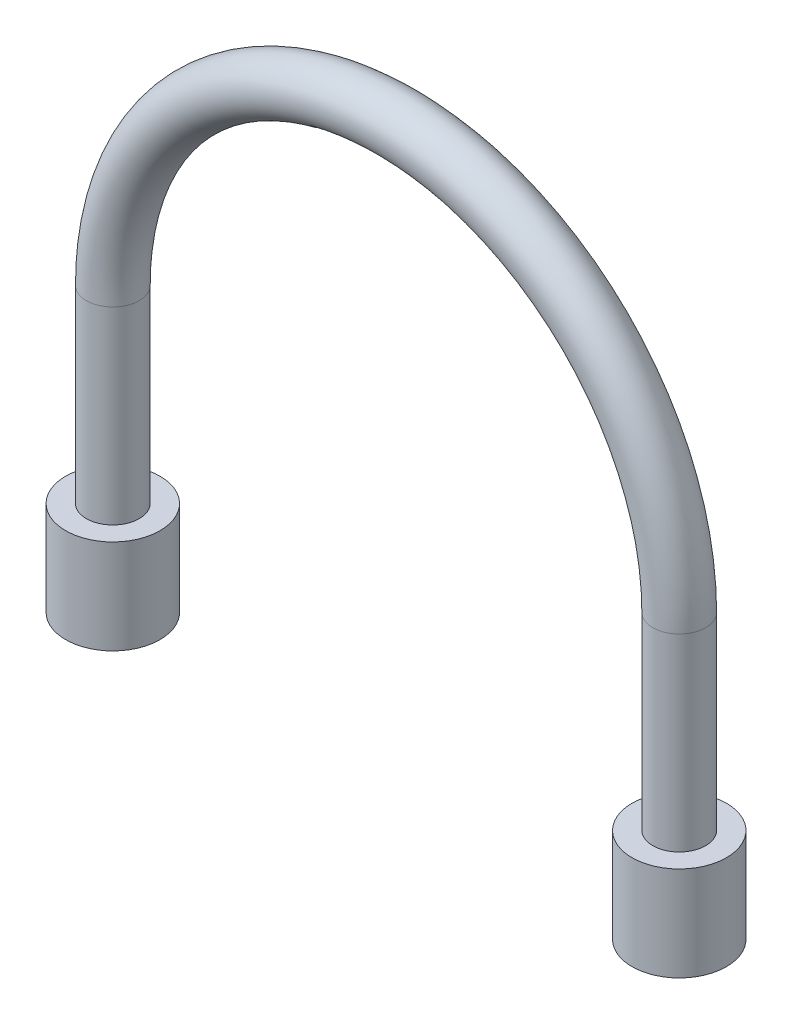
ISO-10303-21;
HEADER;
FILE_DESCRIPTION(('STEP AP214'),'2;1');
FILE_NAME('part.step','',(''),(''),'','','');
FILE_SCHEMA(('AUTOMOTIVE_DESIGN { 1 0 10303 214 1 1 1 1 }'));
ENDSEC;
DATA;
#1=APPLICATION_CONTEXT('core data for automotive mechanical design processes');
#2=APPLICATION_PROTOCOL_DEFINITION('international standard','automotive_design',2000,#1);
#3=PRODUCT_CONTEXT('',#1,'mechanical');
#4=PRODUCT('Part','Part','',(#3));
#5=PRODUCT_RELATED_PRODUCT_CATEGORY('part','',(#4));
#6=PRODUCT_DEFINITION_FORMATION('','',#4);
#7=PRODUCT_DEFINITION_CONTEXT('part definition',#1,'design');
#8=PRODUCT_DEFINITION('design','',#6,#7);
#9=PRODUCT_DEFINITION_SHAPE('','',#8);
#10=(LENGTH_UNIT() NAMED_UNIT(*) SI_UNIT(.MILLI.,.METRE.));
#11=(NAMED_UNIT(*) PLANE_ANGLE_UNIT() SI_UNIT($,.RADIAN.));
#12=(NAMED_UNIT(*) SI_UNIT($,.STERADIAN.) SOLID_ANGLE_UNIT());
#13=UNCERTAINTY_MEASURE_WITH_UNIT(LENGTH_MEASURE(1.E-05),#10,'distance_accuracy_value','');
#14=(GEOMETRIC_REPRESENTATION_CONTEXT(3) GLOBAL_UNCERTAINTY_ASSIGNED_CONTEXT((#13)) GLOBAL_UNIT_ASSIGNED_CONTEXT((#10,
#11,#12)) REPRESENTATION_CONTEXT('',''));
#15=CARTESIAN_POINT('',(0.,0.,0.));
#16=DIRECTION('',(0.,0.,1.));
#17=DIRECTION('',(1.,0.,0.));
#18=AXIS2_PLACEMENT_3D('',#15,#16,#17);
#19=CARTESIAN_POINT('',(0.,12.7,0.));
#20=DIRECTION('',(0.,0.,1.));
#21=DIRECTION('',(1.,0.,0.));
#22=AXIS2_PLACEMENT_3D('',#19,#20,#21);
#23=TOROIDAL_SURFACE('',#22,19.05,1.778);
#24=CARTESIAN_POINT('',(19.05,12.7,0.));
#25=DIRECTION('',(0.,-1.,0.));
#26=DIRECTION('',(0.,0.,1.));
#27=AXIS2_PLACEMENT_3D('',#24,#25,#26);
#28=CIRCLE('',#27,1.778);
#29=CARTESIAN_POINT('',(19.05,12.7,1.778));
#30=VERTEX_POINT('',#29);
#31=EDGE_CURVE('E140',#30,#30,#28,.T.);
#32=ORIENTED_EDGE('',*,*,#31,.F.);
#33=EDGE_LOOP('',(#32));
#34=FACE_BOUND('',#33,.T.);
#35=CARTESIAN_POINT('',(-19.05,12.7,0.));
#36=DIRECTION('',(0.,1.,0.));
#37=DIRECTION('',(0.,0.,1.));
#38=AXIS2_PLACEMENT_3D('',#35,#36,#37);
#39=CIRCLE('',#38,1.778);
#40=CARTESIAN_POINT('',(-19.05,12.7,1.778));
#41=VERTEX_POINT('',#40);
#42=EDGE_CURVE('E143',#41,#41,#39,.T.);
#43=ORIENTED_EDGE('',*,*,#42,.T.);
#44=EDGE_LOOP('',(#43));
#45=FACE_BOUND('',#44,.T.);
#46=CARTESIAN_POINT('',(0.,12.7,-1.29296282227642));
#47=DIRECTION('',(0.,0.,-1.));
#48=DIRECTION('',(-1.,0.,0.));
#49=AXIS2_PLACEMENT_3D('',#46,#47,#48);
#50=CIRCLE('',#49,17.82953650599);
#51=CARTESIAN_POINT('',(1.32814608324219,30.48,-1.29296282227642));
#52=VERTEX_POINT('',#51);
#53=CARTESIAN_POINT('',(4.44765997475827,29.9658823338793,-1.29296282227642));
#54=VERTEX_POINT('',#53);
#55=EDGE_CURVE('E11',#52,#54,#50,.T.);
#56=ORIENTED_EDGE('',*,*,#55,.F.);
#57=CARTESIAN_POINT('',(0.,30.48,1.24434078933386));
#58=CARTESIAN_POINT('',(-0.14832906738404,30.48,1.24433942556282));
#59=CARTESIAN_POINT('',(-0.296656501662229,30.48,1.2462455794243));
#60=CARTESIAN_POINT('',(-0.593219848214549,30.48,1.25374763357387));
#61=CARTESIAN_POINT('',(-0.741455758176201,30.48,1.25934362355559));
#62=CARTESIAN_POINT('',(-1.18599468934,30.48,1.28124371146198));
#63=CARTESIAN_POINT('',(-1.48204669989252,30.48,1.30265965772945));
#64=CARTESIAN_POINT('',(-2.07467912668956,30.48,1.35504578558264));
#65=CARTESIAN_POINT('',(-2.3712551840144,30.48,1.38606163275759));
#66=CARTESIAN_POINT('',(-2.96387386562639,30.48,1.45241304934036));
#67=CARTESIAN_POINT('',(-3.25991653658436,30.48,1.48774822012083));
#68=CARTESIAN_POINT('',(-3.85138148772855,30.48,1.55766919483209));
#69=CARTESIAN_POINT('',(-4.14680357471677,30.48,1.59225657679497));
#70=CARTESIAN_POINT('',(-4.73830046713491,30.48,1.65612287478712));
#71=CARTESIAN_POINT('',(-5.03437537575224,30.48,1.68540088002238));
#72=CARTESIAN_POINT('',(-5.62628317211785,30.48,1.73392949062295));
#73=CARTESIAN_POINT('',(-5.92211282849232,30.48,1.75321716483239));
#74=CARTESIAN_POINT('',(-6.51430938915337,30.48,1.77692960725267));
#75=CARTESIAN_POINT('',(-6.81067594475108,30.48,1.78136191063387));
#76=CARTESIAN_POINT('',(-7.35164844447383,30.48,1.77031120773606));
#77=CARTESIAN_POINT('',(-7.59629816629249,30.48,1.75815561179244));
#78=CARTESIAN_POINT('',(-7.96234364781413,30.48,1.72567046784472));
#79=CARTESIAN_POINT('',(-8.08437145744579,30.48,1.71243868940809));
#80=CARTESIAN_POINT('',(-8.32770409754836,30.48,1.68044444817601));
#81=CARTESIAN_POINT('',(-8.44900899612904,30.48,1.66168251509077));
#82=CARTESIAN_POINT('',(-8.69167175475603,30.48,1.61750733650737));
#83=CARTESIAN_POINT('',(-8.81301805170693,30.48,1.59202955407821));
#84=CARTESIAN_POINT('',(-9.05392476728499,30.48,1.53333176598549));
#85=CARTESIAN_POINT('',(-9.17348424360052,30.48,1.5001078186107));
#86=CARTESIAN_POINT('',(-9.4095199263902,30.48,1.42449247674607));
#87=CARTESIAN_POINT('',(-9.52600034563512,30.48,1.38211442257923));
#88=CARTESIAN_POINT('',(-9.75427039419094,30.48,1.28627748796619));
#89=CARTESIAN_POINT('',(-9.86606622759268,30.48,1.23283385839364));
#90=CARTESIAN_POINT('',(-10.02995072051,30.48,1.14142846542233));
#91=CARTESIAN_POINT('',(-10.0848079643664,30.48,1.10844871773151));
#92=CARTESIAN_POINT('',(-10.1918603571349,30.48,1.03843561412045));
#93=CARTESIAN_POINT('',(-10.2440544584567,30.48,1.00140068077629));
#94=CARTESIAN_POINT('',(-10.39494816687,30.48,0.88389462422178));
#95=CARTESIAN_POINT('',(-10.488786449918,30.48,0.796586395374077));
#96=CARTESIAN_POINT('',(-10.6098945612911,30.48,0.651827121006734));
#97=CARTESIAN_POINT('',(-10.6465430147146,30.48,0.602187611668305));
#98=CARTESIAN_POINT('',(-10.7123352130029,30.48,0.498066057381777));
#99=CARTESIAN_POINT('',(-10.7414797519932,30.48,0.443584525677533));
#100=CARTESIAN_POINT('',(-10.7904506504123,30.48,0.329826580636971));
#101=CARTESIAN_POINT('',(-10.8101772546288,30.48,0.270506306264253));
#102=CARTESIAN_POINT('',(-10.8378879668337,30.48,0.149187714093975));
#103=CARTESIAN_POINT('',(-10.8458877227261,30.48,0.087193078863392));
#104=CARTESIAN_POINT('',(-10.8490760986464,30.48,-0.0303981765128097));
#105=CARTESIAN_POINT('',(-10.8455550100453,30.48,-0.0859626782186291));
#106=CARTESIAN_POINT('',(-10.8288228548039,30.48,-0.195609821040999));
#107=CARTESIAN_POINT('',(-10.8156081078914,30.48,-0.249691891249003));
#108=CARTESIAN_POINT('',(-10.7812551808779,30.48,-0.353059065621651));
#109=CARTESIAN_POINT('',(-10.7604192669774,30.48,-0.402446759640766));
#110=CARTESIAN_POINT('',(-10.7121330873213,30.48,-0.497831226720098));
#111=CARTESIAN_POINT('',(-10.6846809516546,30.48,-0.543827036340136));
#112=CARTESIAN_POINT('',(-10.604570400512,30.48,-0.661339354251319));
#113=CARTESIAN_POINT('',(-10.5472341496546,30.48,-0.729663241715103));
#114=CARTESIAN_POINT('',(-10.4226701482744,30.48,-0.856650735903708));
#115=CARTESIAN_POINT('',(-10.3554118514823,30.48,-0.915283280364058));
#116=CARTESIAN_POINT('',(-10.2248513754438,30.48,-1.01576249795899));
#117=CARTESIAN_POINT('',(-10.1624547131967,30.48,-1.0588084882721));
#118=CARTESIAN_POINT('',(-10.0341609582651,30.48,-1.13937872749011));
#119=CARTESIAN_POINT('',(-9.96826129067002,30.48,-1.17689883598355));
#120=CARTESIAN_POINT('',(-9.833844635062,30.48,-1.24709422191329));
#121=CARTESIAN_POINT('',(-9.76532432686706,30.48,-1.27976307896581));
#122=CARTESIAN_POINT('',(-9.62637485860187,30.48,-1.34078085780379));
#123=CARTESIAN_POINT('',(-9.55594496823854,30.48,-1.36912809859748));
#124=CARTESIAN_POINT('',(-9.341368731157,30.48,-1.44886729184546));
#125=CARTESIAN_POINT('',(-9.19503830342121,30.48,-1.4944060019752));
#126=CARTESIAN_POINT('',(-8.89904671420326,30.48,-1.57311216799833));
#127=CARTESIAN_POINT('',(-8.7493819297414,30.48,-1.60626539438719));
#128=CARTESIAN_POINT('',(-8.44789007572219,30.48,-1.66249429619203));
#129=CARTESIAN_POINT('',(-8.29605930128475,30.48,-1.68554982103882));
#130=CARTESIAN_POINT('',(-8.06764219131946,30.48,-1.71380165919598));
#131=CARTESIAN_POINT('',(-7.99142377220486,30.48,-1.72216149360035));
#132=CARTESIAN_POINT('',(-7.83880026983294,30.48,-1.73695490849018));
#133=CARTESIAN_POINT('',(-7.76239518931195,30.48,-1.74338851704406));
#134=CARTESIAN_POINT('',(-7.52873084161837,30.48,-1.76036155874189));
#135=CARTESIAN_POINT('',(-7.3712621964667,30.48,-1.76806585838981));
#136=CARTESIAN_POINT('',(-7.05613279870614,30.48,-1.77726180339622));
#137=CARTESIAN_POINT('',(-6.8984720109475,30.48,-1.77875205577023));
#138=CARTESIAN_POINT('',(-6.42533198482432,30.48,-1.77545611247559));
#139=CARTESIAN_POINT('',(-6.10990942662233,30.48,-1.76289063314107));
#140=CARTESIAN_POINT('',(-5.47869101709517,30.48,-1.72366317130962));
#141=CARTESIAN_POINT('',(-5.16289954609562,30.48,-1.69693989738216));
#142=CARTESIAN_POINT('',(-4.53211016874405,30.48,-1.63508526638536));
#143=CARTESIAN_POINT('',(-4.21711244992997,30.48,-1.59995208183357));
#144=CARTESIAN_POINT('',(-3.58785056713588,30.48,-1.52688204900654));
#145=CARTESIAN_POINT('',(-3.27358597698632,30.48,-1.48894866716254));
#146=CARTESIAN_POINT('',(-2.64465299008467,30.48,-1.416052692045));
#147=CARTESIAN_POINT('',(-2.32998454422632,30.48,-1.38109050351165));
#148=CARTESIAN_POINT('',(-1.70119091347263,30.48,-1.32051923885632));
#149=CARTESIAN_POINT('',(-1.38707032498647,30.48,-1.29486624078825));
#150=CARTESIAN_POINT('',(-0.915284040640979,30.48,-1.26730557764023));
#151=CARTESIAN_POINT('',(-0.75794007907482,30.48,-1.25993872619587));
#152=CARTESIAN_POINT('',(-0.443112731681238,30.48,-1.24927094460481));
#153=CARTESIAN_POINT('',(-0.285629347858038,30.48,-1.24596995693059));
#154=CARTESIAN_POINT('',(0.0091510729903953,30.48,-1.24380233002499));
#155=CARTESIAN_POINT('',(0.146444463377522,30.48,-1.24442088155517));
#156=CARTESIAN_POINT('',(0.42098042666667,30.48,-1.24887251761324));
#157=CARTESIAN_POINT('',(0.558222998418375,30.48,-1.25270567092883));
#158=CARTESIAN_POINT('',(0.969808116943238,30.48,-1.26878574251349));
#159=CARTESIAN_POINT('',(1.24397585442515,30.48,-1.28561344742461));
#160=CARTESIAN_POINT('',(1.79247908678151,30.48,-1.3286110014619));
#161=CARTESIAN_POINT('',(2.06681188258345,30.48,-1.35481295847462));
#162=CARTESIAN_POINT('',(2.61488940524052,30.48,-1.41253942768396));
#163=CARTESIAN_POINT('',(2.8886341389436,30.48,-1.44406387755647));
#164=CARTESIAN_POINT('',(3.43726944350686,30.48,-1.50855353258454));
#165=CARTESIAN_POINT('',(3.7121592574559,30.48,-1.54152488825208));
#166=CARTESIAN_POINT('',(4.26226628115507,30.48,-1.6049127140827));
#167=CARTESIAN_POINT('',(4.53748351312195,30.48,-1.63532899950668));
#168=CARTESIAN_POINT('',(5.08794583816997,30.48,-1.68983949183663));
#169=CARTESIAN_POINT('',(5.36318948853939,30.48,-1.71394770450439));
#170=CARTESIAN_POINT('',(5.9143531879492,30.48,-1.75214889470619));
#171=CARTESIAN_POINT('',(6.19027302866635,30.48,-1.76624464269961));
#172=CARTESIAN_POINT('',(6.67140758881669,30.48,-1.77835544291611));
#173=CARTESIAN_POINT('',(6.87653305356167,30.48,-1.77957671390768));
#174=CARTESIAN_POINT('',(7.2867987030531,30.48,-1.77202533140112));
#175=CARTESIAN_POINT('',(7.49193876097776,30.48,-1.76324445210929));
#176=CARTESIAN_POINT('',(7.90115247435911,30.48,-1.73308780454988));
#177=CARTESIAN_POINT('',(8.10522707770305,30.48,-1.71172638035673));
#178=CARTESIAN_POINT('',(8.40950537652082,30.48,-1.66766496738101));
#179=CARTESIAN_POINT('',(8.51058720571081,30.48,-1.65098337334524));
#180=CARTESIAN_POINT('',(8.71188268428595,30.48,-1.61305264813645));
#181=CARTESIAN_POINT('',(8.81209650180911,30.48,-1.59180442310125));
#182=CARTESIAN_POINT('',(9.01208651068393,30.48,-1.54389019614019));
#183=CARTESIAN_POINT('',(9.11185270830269,30.48,-1.51718201565267));
#184=CARTESIAN_POINT('',(9.30951760190453,30.48,-1.45763691024503));
#185=CARTESIAN_POINT('',(9.40741707479925,30.48,-1.42480259915725));
#186=CARTESIAN_POINT('',(9.60013292242879,30.48,-1.35212559209844));
#187=CARTESIAN_POINT('',(9.69496071316949,30.48,-1.31231353800598));
#188=CARTESIAN_POINT('',(9.88061747215869,30.48,-1.22435342154715));
#189=CARTESIAN_POINT('',(9.97145090701926,30.48,-1.17621498347693));
#190=CARTESIAN_POINT('',(10.1302974616286,30.48,-1.08021602169051));
#191=CARTESIAN_POINT('',(10.1993424065375,30.48,-1.03407851195558));
#192=CARTESIAN_POINT('',(10.3320086148843,30.48,-0.934277020210657));
#193=CARTESIAN_POINT('',(10.3956225576246,30.48,-0.880603129322188));
#194=CARTESIAN_POINT('',(10.515551643698,30.48,-0.764144693351037));
#195=CARTESIAN_POINT('',(10.5717699075468,30.48,-0.701258431170665));
#196=CARTESIAN_POINT('',(10.6720292306713,30.48,-0.56641844171707));
#197=CARTESIAN_POINT('',(10.7161097310636,30.48,-0.494495216351746));
#198=CARTESIAN_POINT('',(10.7750916687023,30.48,-0.368507451665385));
#199=CARTESIAN_POINT('',(10.7948177388062,30.48,-0.316705749988697));
#200=CARTESIAN_POINT('',(10.825443370375,30.48,-0.210544983639697));
#201=CARTESIAN_POINT('',(10.836350940626,30.48,-0.15618828695276));
#202=CARTESIAN_POINT('',(10.8484079659992,30.48,-0.0461542017571828));
#203=CARTESIAN_POINT('',(10.8495167991245,30.48,0.00952772598494627));
#204=CARTESIAN_POINT('',(10.8417614129888,30.48,0.120194277611967));
#205=CARTESIAN_POINT('',(10.832894500337,30.48,0.175178709122888));
#206=CARTESIAN_POINT('',(10.8066977491258,30.48,0.280059863514624));
#207=CARTESIAN_POINT('',(10.7898232182848,30.48,0.330073009444002));
#208=CARTESIAN_POINT('',(10.7490160123,30.48,0.427097983301613));
#209=CARTESIAN_POINT('',(10.725080601464,30.48,0.474108639330611));
#210=CARTESIAN_POINT('',(10.6566951128115,30.48,0.589535976970096));
#211=CARTESIAN_POINT('',(10.6081942134619,30.48,0.655548232868828));
#212=CARTESIAN_POINT('',(10.5014413000173,30.48,0.779174809891888));
#213=CARTESIAN_POINT('',(10.4431625518463,30.48,0.836765273838413));
#214=CARTESIAN_POINT('',(10.3308507065241,30.48,0.934632715330537));
#215=CARTESIAN_POINT('',(10.2778942528661,30.48,0.976169494304859));
#216=CARTESIAN_POINT('',(10.1685665263106,30.48,1.05450774571796));
#217=CARTESIAN_POINT('',(10.112192944558,30.48,1.09130596279223));
#218=CARTESIAN_POINT('',(9.9391224263203,30.48,1.19543520699848));
#219=CARTESIAN_POINT('',(9.8185937069245,30.48,1.25640395191931));
#220=CARTESIAN_POINT('',(9.57476575623712,30.48,1.36341156777672));
#221=CARTESIAN_POINT('',(9.45160241712499,30.48,1.40977360310973));
#222=CARTESIAN_POINT('',(9.2017305743854,30.48,1.49199269082286));
#223=CARTESIAN_POINT('',(9.07501871576376,30.48,1.52783940693972));
#224=CARTESIAN_POINT('',(8.81928464686741,30.48,1.59081961798084));
#225=CARTESIAN_POINT('',(8.69025912968739,30.48,1.61793938176508));
#226=CARTESIAN_POINT('',(8.4309490229616,30.48,1.66478267959233));
#227=CARTESIAN_POINT('',(8.30066494133482,30.48,1.6845090791536));
#228=CARTESIAN_POINT('',(8.01894501398694,30.48,1.72027642205753));
#229=CARTESIAN_POINT('',(7.86737752288083,30.48,1.73526366721783));
#230=CARTESIAN_POINT('',(7.56369623842292,30.48,1.75823243680003));
#231=CARTESIAN_POINT('',(7.41158231489704,30.48,1.7662121629764));
#232=CARTESIAN_POINT('',(7.10702290388956,30.48,1.77627770585907));
#233=CARTESIAN_POINT('',(6.95457723771584,30.48,1.77835776492963));
#234=CARTESIAN_POINT('',(6.6496926348516,30.48,1.77754333111031));
#235=CARTESIAN_POINT('',(6.49725370092686,30.48,1.77464826900744));
#236=CARTESIAN_POINT('',(6.0391611469432,30.48,1.75970890486243));
#237=CARTESIAN_POINT('',(5.73371622093876,30.48,1.7413888817909));
#238=CARTESIAN_POINT('',(5.12394378911408,30.48,1.69371989557828));
#239=CARTESIAN_POINT('',(4.81961576486805,30.48,1.66437695085645));
#240=CARTESIAN_POINT('',(4.13876731975432,30.48,1.59191405134278));
#241=CARTESIAN_POINT('',(3.7624278120555,30.48,1.54717767784355));
#242=CARTESIAN_POINT('',(3.00956349801014,30.48,1.45809153010534));
#243=CARTESIAN_POINT('',(2.63303867199379,30.48,1.41374189144585));
#244=CARTESIAN_POINT('',(2.0684750888351,30.48,1.35547211709366));
#245=CARTESIAN_POINT('',(1.88087591771911,30.48,1.3374655997062));
#246=CARTESIAN_POINT('',(1.50534369944697,30.48,1.3054201572868));
#247=CARTESIAN_POINT('',(1.31741067429532,30.48,1.29138097986525));
#248=CARTESIAN_POINT('',(0.941325040596504,30.48,1.26839516570356));
#249=CARTESIAN_POINT('',(0.753172602353507,30.48,1.25944582012091));
#250=CARTESIAN_POINT('',(0.376679227518953,30.48,1.24741959379795));
#251=CARTESIAN_POINT('',(0.188338297295176,30.48,1.24434252095881));
#252=CARTESIAN_POINT('',(0.,30.48,1.24434078933386));
#253=B_SPLINE_CURVE_WITH_KNOTS('',3,(#57,#58,#59,#60,#61,#62,#63,#64,#65,#66,#67,#68,#69,#70,
#71,#72,#73,#74,#75,#76,#77,#78,#79,#80,#81,#82,#83,#84,#85,#86,#87,#88,#89,#90,#91,#92,#93,#94,
#95,#96,#97,#98,#99,#100,#101,#102,#103,#104,#105,#106,#107,#108,#109,#110,#111,#112,#113,#114,
#115,#116,#117,#118,#119,#120,#121,#122,#123,#124,#125,#126,#127,#128,#129,#130,#131,#132,#133,
#134,#135,#136,#137,#138,#139,#140,#141,#142,#143,#144,#145,#146,#147,#148,#149,#150,#151,#152,
#153,#154,#155,#156,#157,#158,#159,#160,#161,#162,#163,#164,#165,#166,#167,#168,#169,#170,#171,
#172,#173,#174,#175,#176,#177,#178,#179,#180,#181,#182,#183,#184,#185,#186,#187,#188,#189,#190,
#191,#192,#193,#194,#195,#196,#197,#198,#199,#200,#201,#202,#203,#204,#205,#206,#207,#208,#209,
#210,#211,#212,#213,#214,#215,#216,#217,#218,#219,#220,#221,#222,#223,#224,#225,#226,#227,#228,
#229,#230,#231,#232,#233,#234,#235,#236,#237,#238,#239,#240,#241,#242,#243,#244,#245,#246,#247,
#248,#249,#250,#251,#252),.UNSPECIFIED.,.T.,.F.,(4,2,2,2,2,2,2,2,2,2,2,2,2,2,2,2,2,2,2,2,2,2,2,
2,2,2,2,2,2,2,2,2,2,2,2,2,2,2,2,2,2,2,2,2,2,2,2,2,2,2,2,2,2,2,2,2,2,2,2,2,2,2,2,2,2,2,2,2,2,2,2,
2,2,2,2,2,2,2,2,2,2,2,2,2,2,2,2,2,2,2,2,2,2,2,2,2,2,4),(0.,0.444972317638721,0.889955452194997,
1.78016809287813,2.67468219803914,3.56911381135525,4.4614248427278,5.35388880058702,
6.24301713629593,7.1316944063055,7.86591890793942,8.23404705913002,8.6021399603284,
8.9739079258096,9.34586548351704,9.71728459930834,10.0881951826489,10.2800386285171,
10.4719569663415,10.8530144138296,11.0376265896529,11.2222192202723,11.4087259197758,
11.5949835238869,11.7611253428813,11.9273302715673,12.087553765016,12.2478225948776,
12.5138711625045,12.7807565817674,13.0078466051363,13.2351059253188,13.4626633812449,
13.6903091262589,14.1492762771512,14.6087691189314,15.0691747740957,15.2991827356258,
15.5291873453813,16.001992769713,16.4749041757321,17.4213696895895,18.3719664988293,
19.3227700615778,20.2724157272753,21.2221905483956,22.1674240874924,22.6399267753865,
23.1124227778093,23.5242686267752,23.9361232888555,24.7599291575529,25.5865841017607,
26.4132293668658,27.2438143816146,28.0744593985069,28.9032441837919,29.7317995540387,
30.3469947969638,30.962696343522,31.5776972354288,31.8849605340074,32.1921629197902,
32.5018347984852,32.8113748505769,33.1195881808266,33.42744760573,33.6761676246443,
33.9252177788254,34.1772603012596,34.4284738892864,34.594109521783,34.759594557779,
34.9257653142786,35.0919809466411,35.2497083032802,35.4074968508012,35.6518448076776,
35.8968720727827,36.0984950023375,36.3002557149802,36.7042301485806,37.0985103596206,
37.4931768481964,37.8884613096662,38.2835924080628,38.7403119572356,39.1971486739948,
39.6544310762173,40.1117658004658,41.029384691485,41.9465032970466,43.0834543897879,
44.2207892212314,44.7861408182682,45.3514564413241,45.916470917409,46.4814669099381),.UNSPECIFIED.);
#254=CARTESIAN_POINT('',(-1.32814608325983,30.48,-1.29296282227642));
#255=VERTEX_POINT('',#254);
#256=EDGE_CURVE('E54',#255,#52,#253,.T.);
#257=ORIENTED_EDGE('',*,*,#256,.F.);
#258=CARTESIAN_POINT('',(-4.44765997475827,29.9658823338793,-1.29296282227642));
#259=VERTEX_POINT('',#258);
#260=EDGE_CURVE('E55',#259,#255,#50,.T.);
#261=ORIENTED_EDGE('',*,*,#260,.F.);
#262=CARTESIAN_POINT('',(-4.44765997475827,29.6423570587393,-0.899684095758082));
#263=CARTESIAN_POINT('',(-4.44765997475827,29.6951251936392,-0.986673349579384));
#264=CARTESIAN_POINT('',(-4.44765997475827,29.7554671300749,-1.06917196035064));
#265=CARTESIAN_POINT('',(-4.44765997475827,29.8892963288868,-1.22284832601512));
#266=CARTESIAN_POINT('',(-4.44765997475827,29.9628043937763,-1.29400782389652));
#267=CARTESIAN_POINT('',(-4.44765997475827,30.1205020589771,-1.42297289547455));
#268=CARTESIAN_POINT('',(-4.44765997475827,30.2046722414577,-1.48080221931795));
#269=CARTESIAN_POINT('',(-4.44765997475827,30.3813207404602,-1.58184952743331));
#270=CARTESIAN_POINT('',(-4.44765997475827,30.4737968657575,-1.62507135112197));
#271=CARTESIAN_POINT('',(-4.44765997475827,30.6666555086665,-1.69671003374853));
#272=CARTESIAN_POINT('',(-4.44765997475827,30.7671677862571,-1.72477773843488));
#273=CARTESIAN_POINT('',(-4.44765997475827,30.9714559287488,-1.7639383275001));
#274=CARTESIAN_POINT('',(-4.44765997475827,31.0752323036646,-1.77502854556668));
#275=CARTESIAN_POINT('',(-4.44765997475827,31.2848416051194,-1.77996629546093));
#276=CARTESIAN_POINT('',(-4.44765997475827,31.3906811497027,-1.77353907506353));
#277=CARTESIAN_POINT('',(-4.44765997475827,31.59977278618,-1.74295281586985));
#278=CARTESIAN_POINT('',(-4.44765997475827,31.7030248555206,-1.71879362257114));
#279=CARTESIAN_POINT('',(-4.44765997475827,31.9036075454909,-1.65339762386764));
#280=CARTESIAN_POINT('',(-4.44765997475827,32.0009564026979,-1.61221684668559));
#281=CARTESIAN_POINT('',(-4.44765997475827,32.1871729971936,-1.51379570862488));
#282=CARTESIAN_POINT('',(-4.44765997475827,32.2760415004084,-1.45655679992307));
#283=CARTESIAN_POINT('',(-4.44765997475827,32.440965849671,-1.32873971673809));
#284=CARTESIAN_POINT('',(-4.44765997475827,32.5172294220021,-1.25842970854161));
#285=CARTESIAN_POINT('',(-4.44765997475827,32.6565009352506,-1.10571564426455));
#286=CARTESIAN_POINT('',(-4.44765997475827,32.7195107093897,-1.02331326344126));
#287=CARTESIAN_POINT('',(-4.44765997475827,32.8288361945048,-0.850942664160257));
#288=CARTESIAN_POINT('',(-4.44765997475827,32.8755256408839,-0.761211452274834));
#289=CARTESIAN_POINT('',(-4.44765997475827,32.9528104110612,-0.575066770091401));
#290=CARTESIAN_POINT('',(-4.44765997475827,32.9834078210462,-0.478654167810159));
#291=CARTESIAN_POINT('',(-4.44765997475827,33.0270363885276,-0.284033872242012));
#292=CARTESIAN_POINT('',(-4.44765997475827,33.0404180106438,-0.185904632801517));
#293=CARTESIAN_POINT('',(-4.44765997475827,33.0503410977045,0.011198877584277));
#294=CARTESIAN_POINT('',(-4.44765997475827,33.0468837792862,0.110173086963526));
#295=CARTESIAN_POINT('',(-4.44765997475827,33.0233574913348,0.305162529772513));
#296=CARTESIAN_POINT('',(-4.44765997475827,33.0034472554391,0.401196980424917));
#297=CARTESIAN_POINT('',(-4.44765997475827,32.9478537458055,0.588581349385725));
#298=CARTESIAN_POINT('',(-4.44765997475827,32.9121704539884,0.679931262324536));
#299=CARTESIAN_POINT('',(-4.44765997475827,32.8259518136468,0.855820784695065));
#300=CARTESIAN_POINT('',(-4.44765997475827,32.7753520805958,0.940328803563293));
#301=CARTESIAN_POINT('',(-4.44765997475827,32.660902327208,1.09983063375279));
#302=CARTESIAN_POINT('',(-4.44765997475827,32.5970514037158,1.17482379601256));
#303=CARTESIAN_POINT('',(-4.44765997475827,32.4568104120412,1.31453778152089));
#304=CARTESIAN_POINT('',(-4.44765997475827,32.3802289797054,1.37906642685735));
#305=CARTESIAN_POINT('',(-4.44765997475827,32.2175323892254,1.49470296988847));
#306=CARTESIAN_POINT('',(-4.44765997475827,32.1314161542511,1.54580934951316));
#307=CARTESIAN_POINT('',(-4.44765997475827,31.9499243189372,1.63443703099047));
#308=CARTESIAN_POINT('',(-4.44765997475827,31.8543779567365,1.67160863165959));
#309=CARTESIAN_POINT('',(-4.44765997475827,31.658483743162,1.72977996440748));
#310=CARTESIAN_POINT('',(-4.44765997475827,31.5581352888465,1.75077766003236));
#311=CARTESIAN_POINT('',(-4.44765997475827,31.3530782284596,1.77644392841716));
#312=CARTESIAN_POINT('',(-4.44765997475827,31.2483223130024,1.78073531176855));
#313=CARTESIAN_POINT('',(-4.44765997475827,31.0395439369408,1.77189554074552));
#314=CARTESIAN_POINT('',(-4.44765997475827,30.935521544752,1.75876278227966));
#315=CARTESIAN_POINT('',(-4.44765997475827,30.7298775070245,1.71516203901682));
#316=CARTESIAN_POINT('',(-4.44765997475827,30.6282989162488,1.684490480013));
#317=CARTESIAN_POINT('',(-4.44765997475827,30.4317723339399,1.60642957826865));
#318=CARTESIAN_POINT('',(-4.44765997475827,30.3368243880736,1.55904012040141));
#319=CARTESIAN_POINT('',(-4.44765997475827,30.1569620966647,1.44908204169032));
#320=CARTESIAN_POINT('',(-4.44765997475827,30.0719893421436,1.38660908713485));
#321=CARTESIAN_POINT('',(-4.44765997475827,29.9140681183662,1.24795534963223));
#322=CARTESIAN_POINT('',(-4.44765997475827,29.8411181740553,1.17177625066682));
#323=CARTESIAN_POINT('',(-4.44765997475827,29.7112908072355,1.00982012281524));
#324=CARTESIAN_POINT('',(-4.44765997475827,29.6540638988195,0.924323433799443));
#325=CARTESIAN_POINT('',(-4.44765997475827,29.5553372992935,0.744688622466349));
#326=CARTESIAN_POINT('',(-4.44765997475827,29.5138337375562,0.650552633989013));
#327=CARTESIAN_POINT('',(-4.44765997475827,29.4491109140748,0.459575109080514));
#328=CARTESIAN_POINT('',(-4.44765997475827,29.4253456079911,0.362918476390398));
#329=CARTESIAN_POINT('',(-4.44765997475827,29.3947877861842,0.166933004869579));
#330=CARTESIAN_POINT('',(-4.44765997475827,29.3879971639292,0.0676038691792107));
#331=CARTESIAN_POINT('',(-4.44765997475827,29.3915965651462,-0.128562266697629));
#332=CARTESIAN_POINT('',(-4.44765997475827,29.401616470397,-0.225406519635093));
#333=CARTESIAN_POINT('',(-4.44765997475827,29.4377827383768,-0.415942777689523));
#334=CARTESIAN_POINT('',(-4.44765997475827,29.4639081674827,-0.509638708494756));
#335=CARTESIAN_POINT('',(-4.44765997475827,29.5169129505252,-0.652475196540216));
#336=CARTESIAN_POINT('',(-4.44765997475827,29.538709537935,-0.703561383041722));
#337=CARTESIAN_POINT('',(-4.44765997475827,29.5870385622628,-0.803438493684511));
#338=CARTESIAN_POINT('',(-4.44765997475827,29.6135708480786,-0.852229490995784));
#339=CARTESIAN_POINT('',(-4.44765997475827,29.6423570587393,-0.899684095758082));
#340=B_SPLINE_CURVE_WITH_KNOTS('',3,(#262,#263,#264,#265,#266,#267,#268,#269,#270,#271,#272,
#273,#274,#275,#276,#277,#278,#279,#280,#281,#282,#283,#284,#285,#286,#287,#288,#289,#290,#291,
#292,#293,#294,#295,#296,#297,#298,#299,#300,#301,#302,#303,#304,#305,#306,#307,#308,#309,#310,
#311,#312,#313,#314,#315,#316,#317,#318,#319,#320,#321,#322,#323,#324,#325,#326,#327,#328,#329,
#330,#331,#332,#333,#334,#335,#336,#337,#338,#339),.UNSPECIFIED.,.T.,.F.,(4,2,2,2,2,2,2,2,2,2,2,
2,2,2,2,2,2,2,2,2,2,2,2,2,2,2,2,2,2,2,2,2,2,2,2,2,2,2,4),(0.,0.305018151278483,
0.610522552892204,0.915478361146573,1.22035395275509,1.53198287939477,1.84366074230185,
2.16025512935855,2.47685227500194,2.7924155054525,3.10795020792753,3.41761079280618,
3.72722851824939,4.02920247738343,4.33113727867363,4.62682288395491,4.92248712585355,
5.21533172668452,5.50817666317749,5.80230460452207,6.09645259920065,6.39550630358441,
6.69459381665209,7.00075155601063,7.30694783734448,7.62001853914058,7.93311806467346,
8.24992774435461,8.56673960576716,8.88159258228504,9.19640690132003,9.50352092851382,
9.81055930403031,10.1077047020689,10.4048832441885,10.6956042853743,10.9859482478292,
11.1523478540999,11.3187421519977),.UNSPECIFIED.);
#341=CARTESIAN_POINT('',(-4.44765997475827,29.9658823338793,1.29296282227642));
#342=VERTEX_POINT('',#341);
#343=EDGE_CURVE('E178',#342,#259,#340,.T.);
#344=ORIENTED_EDGE('',*,*,#343,.F.);
#345=CARTESIAN_POINT('',(0.,12.7,1.29296282227642));
#346=DIRECTION('',(0.,0.,1.));
#347=DIRECTION('',(1.,0.,0.));
#348=AXIS2_PLACEMENT_3D('',#345,#346,#347);
#349=CIRCLE('',#348,17.82953650599);
#350=CARTESIAN_POINT('',(-1.3281460832601,30.48,1.29296282227642));
#351=VERTEX_POINT('',#350);
#352=EDGE_CURVE('E70',#351,#342,#349,.T.);
#353=ORIENTED_EDGE('',*,*,#352,.F.);
#354=CARTESIAN_POINT('',(1.32814608327773,30.48,1.29296282227892));
#355=VERTEX_POINT('',#354);
#356=EDGE_CURVE('E105',#355,#351,#253,.T.);
#357=ORIENTED_EDGE('',*,*,#356,.F.);
#358=CARTESIAN_POINT('',(4.44765997475827,29.9658823338686,1.29296282227642));
#359=VERTEX_POINT('',#358);
#360=EDGE_CURVE('E182',#359,#355,#349,.T.);
#361=ORIENTED_EDGE('',*,*,#360,.F.);
#362=CARTESIAN_POINT('',(4.44765997475827,29.6423570587393,-0.899684095758082));
#363=CARTESIAN_POINT('',(4.44765997475827,29.5917820165739,-0.816293262561566));
#364=CARTESIAN_POINT('',(4.44765997475827,29.5480920023384,-0.728658318400231));
#365=CARTESIAN_POINT('',(4.44765997475827,29.4759523473589,-0.547254884666396));
#366=CARTESIAN_POINT('',(4.44765997475827,29.4475156577865,-0.453481258461572));
#367=CARTESIAN_POINT('',(4.44765997475827,29.4068849701377,-0.262433448047957));
#368=CARTESIAN_POINT('',(4.44765997475827,29.3946961743417,-0.165158152901812));
#369=CARTESIAN_POINT('',(4.44765997475827,29.3870154362259,0.030029529654945));
#370=CARTESIAN_POINT('',(4.44765997475827,29.3915199840229,0.127941778820557));
#371=CARTESIAN_POINT('',(4.44765997475827,29.416929603581,0.32062686008244));
#372=CARTESIAN_POINT('',(4.44765997475827,29.4376729681807,0.415421095526327));
#373=CARTESIAN_POINT('',(4.44765997475827,29.4946545847596,0.600226871278536));
#374=CARTESIAN_POINT('',(4.44765997475827,29.5308935575976,0.69023818886551));
#375=CARTESIAN_POINT('',(4.44765997475827,29.6180396231722,0.86377725732966));
#376=CARTESIAN_POINT('',(4.44765997475827,29.669065243679,0.947245402412815));
#377=CARTESIAN_POINT('',(4.44765997475827,29.7840601626249,1.10472218791867));
#378=CARTESIAN_POINT('',(4.44765997475827,29.8480309815076,1.17872971550233));
#379=CARTESIAN_POINT('',(4.44765997475827,29.9888976618416,1.31732402478537));
#380=CARTESIAN_POINT('',(4.44765997475827,30.0660936046676,1.38160568735278));
#381=CARTESIAN_POINT('',(4.44765997475827,30.2299062642548,1.49676332164065));
#382=CARTESIAN_POINT('',(4.44765997475827,30.3165244570493,1.54763718869107));
#383=CARTESIAN_POINT('',(4.44765997475827,30.4996066448934,1.63615891392778));
#384=CARTESIAN_POINT('',(4.44765997475827,30.5962925778567,1.67334802927496));
#385=CARTESIAN_POINT('',(4.44765997475827,30.7944621133567,1.7313394959053));
#386=CARTESIAN_POINT('',(4.44765997475827,30.8959463279105,1.75213975079275));
#387=CARTESIAN_POINT('',(4.44765997475827,31.1030697028286,1.77709266515774));
#388=CARTESIAN_POINT('',(4.44765997475827,31.20875138962,1.78089383088256));
#389=CARTESIAN_POINT('',(4.44765997475827,31.4192652577578,1.7707481954071));
#390=CARTESIAN_POINT('',(4.44765997475827,31.524097404611,1.75680067716625));
#391=CARTESIAN_POINT('',(4.44765997475827,31.7301479450109,1.71139166520765));
#392=CARTESIAN_POINT('',(4.44765997475827,31.8313579243849,1.67989189448724));
#393=CARTESIAN_POINT('',(4.44765997475827,32.0269307665435,1.60009343218818));
#394=CARTESIAN_POINT('',(4.44765997475827,32.1212940553675,1.55179578695276));
#395=CARTESIAN_POINT('',(4.44765997475827,32.2989355673818,1.4404803906634));
#396=CARTESIAN_POINT('',(4.44765997475827,32.3823587421792,1.37769412672943));
#397=CARTESIAN_POINT('',(4.44765997475827,32.5371501775996,1.23869056932644));
#398=CARTESIAN_POINT('',(4.44765997475827,32.6085200203838,1.16247504131574));
#399=CARTESIAN_POINT('',(4.44765997475827,32.7353405235326,1.00073639789691));
#400=CARTESIAN_POINT('',(4.44765997475827,32.7911324184498,0.915480858722338));
#401=CARTESIAN_POINT('',(4.44765997475827,32.8872205971266,0.736642717909945));
#402=CARTESIAN_POINT('',(4.44765997475827,32.9275190196079,0.643061267780076));
#403=CARTESIAN_POINT('',(4.44765997475827,32.9905546976119,0.452526008072873));
#404=CARTESIAN_POINT('',(4.44765997475827,33.0136707121179,0.355697402144994));
#405=CARTESIAN_POINT('',(4.44765997475827,33.0430752123146,0.15952000402179));
#406=CARTESIAN_POINT('',(4.44765997475827,33.0493652439958,0.0601714442095047));
#407=CARTESIAN_POINT('',(4.44765997475827,33.0449439705046,-0.136824177170146));
#408=CARTESIAN_POINT('',(4.44765997475827,33.0344566302986,-0.234476352671657));
#409=CARTESIAN_POINT('',(4.44765997475827,32.9972376164605,-0.426629914229119));
#410=CARTESIAN_POINT('',(4.44765997475827,32.9705062643951,-0.52113136261784));
#411=CARTESIAN_POINT('',(4.44765997475827,32.9016319088302,-0.70437161946245));
#412=CARTESIAN_POINT('',(4.44765997475827,32.8594834365262,-0.793108369878874));
#413=CARTESIAN_POINT('',(4.44765997475827,32.7610776483372,-0.962373124985787));
#414=CARTESIAN_POINT('',(4.44765997475827,32.7048196337844,-1.04290072290264));
#415=CARTESIAN_POINT('',(4.44765997475827,32.5790261167679,-1.19466527303675));
#416=CARTESIAN_POINT('',(4.44765997475827,32.5093212360333,-1.2657617496491));
#417=CARTESIAN_POINT('',(4.44765997475827,32.3591954697137,-1.39555294983795));
#418=CARTESIAN_POINT('',(4.44765997475827,32.2787734607105,-1.45424637159954));
#419=CARTESIAN_POINT('',(4.44765997475827,32.1075867608085,-1.55897739785217));
#420=CARTESIAN_POINT('',(4.44765997475827,32.0166309888482,-1.60470261160615));
#421=CARTESIAN_POINT('',(4.44765997475827,31.8284603317546,-1.68063783993124));
#422=CARTESIAN_POINT('',(4.44765997475827,31.731244649914,-1.71084587520018));
#423=CARTESIAN_POINT('',(4.44765997475827,31.5308435181759,-1.75560953113342));
#424=CARTESIAN_POINT('',(4.44765997475827,31.4275711042798,-1.76977614346652));
#425=CARTESIAN_POINT('',(4.44765997475827,31.2201055088491,-1.78086670294266));
#426=CARTESIAN_POINT('',(4.44765997475827,31.1159122626672,-1.77778942971737));
#427=CARTESIAN_POINT('',(4.44765997475827,30.9078258635248,-1.75432420976553));
#428=CARTESIAN_POINT('',(4.44765997475827,30.8039632267705,-1.733664655875));
#429=CARTESIAN_POINT('',(4.44765997475827,30.601145888904,-1.67519230445116));
#430=CARTESIAN_POINT('',(4.44765997475827,30.5021925637523,-1.6373747277359));
#431=CARTESIAN_POINT('',(4.44765997475827,30.3121180654445,-1.54554099396049));
#432=CARTESIAN_POINT('',(4.44765997475827,30.2209964203778,-1.49152581379498));
#433=CARTESIAN_POINT('',(4.44765997475827,30.0494366898981,-1.36870736437158));
#434=CARTESIAN_POINT('',(4.44765997475827,29.9689850716256,-1.29992312264574));
#435=CARTESIAN_POINT('',(4.44765997475827,29.8469753136196,-1.17561920358286));
#436=CARTESIAN_POINT('',(4.44765997475827,29.8016092059531,-1.12378093817971));
#437=CARTESIAN_POINT('',(4.44765997475827,29.7171390875761,-1.01522708535502));
#438=CARTESIAN_POINT('',(4.44765997475827,29.6780349033103,-0.95851163317658));
#439=CARTESIAN_POINT('',(4.44765997475827,29.6423570587393,-0.899684095758082));
#440=B_SPLINE_CURVE_WITH_KNOTS('',3,(#362,#363,#364,#365,#366,#367,#368,#369,#370,#371,#372,
#373,#374,#375,#376,#377,#378,#379,#380,#381,#382,#383,#384,#385,#386,#387,#388,#389,#390,#391,
#392,#393,#394,#395,#396,#397,#398,#399,#400,#401,#402,#403,#404,#405,#406,#407,#408,#409,#410,
#411,#412,#413,#414,#415,#416,#417,#418,#419,#420,#421,#422,#423,#424,#425,#426,#427,#428,#429,
#430,#431,#432,#433,#434,#435,#436,#437,#438,#439),.UNSPECIFIED.,.T.,.F.,(4,2,2,2,2,2,2,2,2,2,2,
2,2,2,2,2,2,2,2,2,2,2,2,2,2,2,2,2,2,2,2,2,2,2,2,2,2,2,4),(0.,0.292342889999951,
0.584933608833948,0.877617987416199,1.17024083070922,1.45998621998763,1.7497450897469,
2.04189410558904,2.3340774549462,2.63408014076828,2.93412989108325,3.24347837688111,
3.55286642684534,3.86862303636015,4.18439240273556,4.50085309215898,4.81729407270699,
5.1289919895429,5.44064896000483,5.74481909755131,6.04894723231026,6.3461545300965,
6.64333451919918,6.93658037669878,7.22982042928889,7.5231646018529,7.81652330292438,
8.11385195834896,8.41121180567282,8.71522182055091,9.01927060396905,9.33054453642883,
9.64184049835803,9.95803444218504,10.2743165125412,10.5905795114255,10.9064374758669,
11.1126746411715,11.3189060894168),.UNSPECIFIED.);
#441=EDGE_CURVE('E45',#54,#359,#440,.T.);
#442=ORIENTED_EDGE('',*,*,#441,.F.);
#443=EDGE_LOOP('',(#56,#257,#261,#344,#353,#357,#361,#442));
#444=FACE_BOUND('',#443,.T.);
#445=ADVANCED_FACE('F41',(#34,#45,#444),#23,.T.);
#446=CARTESIAN_POINT('',(19.05,0.,0.));
#447=DIRECTION('',(0.,1.,0.));
#448=DIRECTION('',(0.,0.,1.));
#449=AXIS2_PLACEMENT_3D('',#446,#447,#448);
#450=CYLINDRICAL_SURFACE('',#449,1.778);
#451=CARTESIAN_POINT('',(19.05,0.,0.));
#452=DIRECTION('',(0.,-1.,0.));
#453=DIRECTION('',(0.,0.,1.));
#454=AXIS2_PLACEMENT_3D('',#451,#452,#453);
#455=CIRCLE('',#454,1.778);
#456=CARTESIAN_POINT('',(19.05,0.,1.778));
#457=VERTEX_POINT('',#456);
#458=EDGE_CURVE('E137',#457,#457,#455,.T.);
#459=CARTESIAN_POINT('',(19.05,12.7,1.778));
#460=CARTESIAN_POINT('',(19.05,12.5677083333333,1.778));
#461=CARTESIAN_POINT('',(19.05,12.4354166666667,1.778));
#462=CARTESIAN_POINT('',(19.05,12.1708333333333,1.778));
#463=CARTESIAN_POINT('',(19.05,12.0385416666667,1.778));
#464=CARTESIAN_POINT('',(19.05,11.7739583333333,1.778));
#465=CARTESIAN_POINT('',(19.05,11.6416666666667,1.778));
#466=CARTESIAN_POINT('',(19.05,11.3770833333333,1.778));
#467=CARTESIAN_POINT('',(19.05,11.2447916666667,1.778));
#468=CARTESIAN_POINT('',(19.05,10.9802083333333,1.778));
#469=CARTESIAN_POINT('',(19.05,10.8479166666667,1.778));
#470=CARTESIAN_POINT('',(19.05,10.5833333333333,1.778));
#471=CARTESIAN_POINT('',(19.05,10.4510416666667,1.778));
#472=CARTESIAN_POINT('',(19.05,10.1864583333333,1.778));
#473=CARTESIAN_POINT('',(19.05,10.0541666666667,1.778));
#474=CARTESIAN_POINT('',(19.05,9.78958333333333,1.778));
#475=CARTESIAN_POINT('',(19.05,9.65729166666667,1.778));
#476=CARTESIAN_POINT('',(19.05,9.39270833333333,1.778));
#477=CARTESIAN_POINT('',(19.05,9.26041666666667,1.778));
#478=CARTESIAN_POINT('',(19.05,8.99583333333334,1.778));
#479=CARTESIAN_POINT('',(19.05,8.86354166666667,1.778));
#480=CARTESIAN_POINT('',(19.05,8.59895833333333,1.778));
#481=CARTESIAN_POINT('',(19.05,8.46666666666667,1.778));
#482=CARTESIAN_POINT('',(19.05,8.20208333333333,1.778));
#483=CARTESIAN_POINT('',(19.05,8.06979166666667,1.778));
#484=CARTESIAN_POINT('',(19.05,7.80520833333333,1.778));
#485=CARTESIAN_POINT('',(19.05,7.67291666666667,1.778));
#486=CARTESIAN_POINT('',(19.05,7.40833333333333,1.778));
#487=CARTESIAN_POINT('',(19.05,7.27604166666667,1.778));
#488=CARTESIAN_POINT('',(19.05,7.01145833333333,1.778));
#489=CARTESIAN_POINT('',(19.05,6.87916666666667,1.778));
#490=CARTESIAN_POINT('',(19.05,6.61458333333333,1.778));
#491=CARTESIAN_POINT('',(19.05,6.48229166666667,1.778));
#492=CARTESIAN_POINT('',(19.05,6.21770833333333,1.778));
#493=CARTESIAN_POINT('',(19.05,6.08541666666667,1.778));
#494=CARTESIAN_POINT('',(19.05,5.82083333333333,1.778));
#495=CARTESIAN_POINT('',(19.05,5.68854166666667,1.778));
#496=CARTESIAN_POINT('',(19.05,5.42395833333333,1.778));
#497=CARTESIAN_POINT('',(19.05,5.29166666666667,1.778));
#498=CARTESIAN_POINT('',(19.05,5.02708333333333,1.778));
#499=CARTESIAN_POINT('',(19.05,4.89479166666667,1.778));
#500=CARTESIAN_POINT('',(19.05,4.63020833333333,1.778));
#501=CARTESIAN_POINT('',(19.05,4.49791666666667,1.778));
#502=CARTESIAN_POINT('',(19.05,4.23333333333333,1.778));
#503=CARTESIAN_POINT('',(19.05,4.10104166666667,1.778));
#504=CARTESIAN_POINT('',(19.05,3.83645833333333,1.778));
#505=CARTESIAN_POINT('',(19.05,3.70416666666667,1.778));
#506=CARTESIAN_POINT('',(19.05,3.43958333333333,1.778));
#507=CARTESIAN_POINT('',(19.05,3.30729166666667,1.778));
#508=CARTESIAN_POINT('',(19.05,3.04270833333333,1.778));
#509=CARTESIAN_POINT('',(19.05,2.91041666666667,1.778));
#510=CARTESIAN_POINT('',(19.05,2.64583333333333,1.778));
#511=CARTESIAN_POINT('',(19.05,2.51354166666667,1.778));
#512=CARTESIAN_POINT('',(19.05,2.24895833333333,1.778));
#513=CARTESIAN_POINT('',(19.05,2.11666666666667,1.778));
#514=CARTESIAN_POINT('',(19.05,1.85208333333333,1.778));
#515=CARTESIAN_POINT('',(19.05,1.71979166666667,1.778));
#516=CARTESIAN_POINT('',(19.05,1.45520833333333,1.778));
#517=CARTESIAN_POINT('',(19.05,1.32291666666667,1.778));
#518=CARTESIAN_POINT('',(19.05,1.05833333333333,1.778));
#519=CARTESIAN_POINT('',(19.05,0.926041666666666,1.778));
#520=CARTESIAN_POINT('',(19.05,0.661458333333333,1.778));
#521=CARTESIAN_POINT('',(19.05,0.529166666666666,1.778));
#522=CARTESIAN_POINT('',(19.05,0.264583333333333,1.778));
#523=CARTESIAN_POINT('',(19.05,0.132291666666666,1.778));
#524=CARTESIAN_POINT('',(19.05,0.,1.778));
#525=B_SPLINE_CURVE_WITH_KNOTS('',3,(#459,#460,#461,#462,#463,#464,#465,#466,#467,#468,#469,
#470,#471,#472,#473,#474,#475,#476,#477,#478,#479,#480,#481,#482,#483,#484,#485,#486,#487,#488,
#489,#490,#491,#492,#493,#494,#495,#496,#497,#498,#499,#500,#501,#502,#503,#504,#505,#506,#507,
#508,#509,#510,#511,#512,#513,#514,#515,#516,#517,#518,#519,#520,#521,#522,#523,#524),
.UNSPECIFIED.,.F.,.F.,(4,2,2,2,2,2,2,2,2,2,2,2,2,2,2,2,2,2,2,2,2,2,2,2,2,2,2,2,2,2,2,2,4),(0.,
0.396875,0.793749999999999,1.190625,1.5875,1.984375,2.38125,2.778125,3.175,3.571875,3.96875,
4.365625,4.7625,5.159375,5.55625,5.953125,6.35,6.746875,7.14375,7.540625,7.9375,8.334375,
8.73125,9.128125,9.525,9.921875,10.31875,10.715625,11.1125,11.509375,11.90625,12.303125,12.7),.UNSPECIFIED.);
#526=EDGE_CURVE('BSEAM201',#30,#457,#525,.T.);
#527=ORIENTED_EDGE('',*,*,#31,.T.);
#528=ORIENTED_EDGE('',*,*,#458,.F.);
#529=ORIENTED_EDGE('',*,*,#526,.T.);
#530=ORIENTED_EDGE('',*,*,#526,.F.);
#531=EDGE_LOOP('',(#527,#529,#528,#530));
#532=FACE_BOUND('',#531,.T.);
#533=ADVANCED_FACE('F201',(#532),#450,.T.);
#534=CARTESIAN_POINT('',(-19.05,12.7,0.));
#535=DIRECTION('',(0.,-1.,0.));
#536=DIRECTION('',(0.,0.,-1.));
#537=AXIS2_PLACEMENT_3D('',#534,#535,#536);
#538=CYLINDRICAL_SURFACE('',#537,1.778);
#539=CARTESIAN_POINT('',(-19.05,0.,0.));
#540=DIRECTION('',(0.,1.,0.));
#541=DIRECTION('',(0.,0.,1.));
#542=AXIS2_PLACEMENT_3D('',#539,#540,#541);
#543=CIRCLE('',#542,1.778);
#544=CARTESIAN_POINT('',(-19.05,0.,1.778));
#545=VERTEX_POINT('',#544);
#546=EDGE_CURVE('E134',#545,#545,#543,.T.);
#547=ORIENTED_EDGE('',*,*,#546,.T.);
#548=EDGE_LOOP('',(#547));
#549=FACE_BOUND('',#548,.T.);
#550=ORIENTED_EDGE('',*,*,#42,.F.);
#551=EDGE_LOOP('',(#550));
#552=FACE_BOUND('',#551,.T.);
#553=ADVANCED_FACE('F43',(#549,#552),#538,.T.);
#554=CARTESIAN_POINT('',(-19.05,-6.35,0.));
#555=DIRECTION('',(0.,1.,0.));
#556=DIRECTION('',(0.,0.,1.));
#557=AXIS2_PLACEMENT_3D('',#554,#555,#556);
#558=CYLINDRICAL_SURFACE('',#557,3.175);
#559=CARTESIAN_POINT('',(-19.05,-6.35,0.));
#560=DIRECTION('',(0.,-1.,0.));
#561=DIRECTION('',(0.,0.,-1.));
#562=AXIS2_PLACEMENT_3D('',#559,#560,#561);
#563=CIRCLE('',#562,3.175);
#564=CARTESIAN_POINT('',(-19.05,-6.35,-3.175));
#565=VERTEX_POINT('',#564);
#566=EDGE_CURVE('E131',#565,#565,#563,.T.);
#567=ORIENTED_EDGE('',*,*,#566,.F.);
#568=EDGE_LOOP('',(#567));
#569=FACE_BOUND('',#568,.T.);
#570=CARTESIAN_POINT('',(-19.05,0.,0.));
#571=DIRECTION('',(0.,-1.,0.));
#572=DIRECTION('',(0.,0.,-1.));
#573=AXIS2_PLACEMENT_3D('',#570,#571,#572);
#574=CIRCLE('',#573,3.175);
#575=CARTESIAN_POINT('',(-19.05,0.,-3.175));
#576=VERTEX_POINT('',#575);
#577=EDGE_CURVE('E129',#576,#576,#574,.T.);
#578=ORIENTED_EDGE('',*,*,#577,.T.);
#579=EDGE_LOOP('',(#578));
#580=FACE_BOUND('',#579,.T.);
#581=ADVANCED_FACE('F207',(#569,#580),#558,.T.);
#582=CARTESIAN_POINT('',(-19.05,-6.35,0.));
#583=DIRECTION('',(0.,-1.,0.));
#584=DIRECTION('',(0.,0.,-1.));
#585=AXIS2_PLACEMENT_3D('',#582,#583,#584);
#586=PLANE('',#585);
#587=ORIENTED_EDGE('',*,*,#566,.T.);
#588=EDGE_LOOP('',(#587));
#589=FACE_BOUND('',#588,.T.);
#590=ADVANCED_FACE('F215',(#589),#586,.T.);
#591=CARTESIAN_POINT('',(-19.05,0.,0.));
#592=DIRECTION('',(0.,-1.,0.));
#593=DIRECTION('',(0.,0.,-1.));
#594=AXIS2_PLACEMENT_3D('',#591,#592,#593);
#595=PLANE('',#594);
#596=ORIENTED_EDGE('',*,*,#546,.F.);
#597=EDGE_LOOP('',(#596));
#598=FACE_BOUND('',#597,.T.);
#599=ORIENTED_EDGE('',*,*,#577,.F.);
#600=EDGE_LOOP('',(#599));
#601=FACE_BOUND('',#600,.T.);
#602=ADVANCED_FACE('F222',(#598,#601),#595,.F.);
#603=CARTESIAN_POINT('',(19.05,-6.35,0.));
#604=DIRECTION('',(0.,1.,0.));
#605=DIRECTION('',(0.,0.,1.));
#606=AXIS2_PLACEMENT_3D('',#603,#604,#605);
#607=CYLINDRICAL_SURFACE('',#606,3.175);
#608=CARTESIAN_POINT('',(19.05,-6.35,0.));
#609=DIRECTION('',(0.,-1.,0.));
#610=DIRECTION('',(0.,0.,-1.));
#611=AXIS2_PLACEMENT_3D('',#608,#609,#610);
#612=CIRCLE('',#611,3.175);
#613=CARTESIAN_POINT('',(19.05,-6.35,-3.175));
#614=VERTEX_POINT('',#613);
#615=EDGE_CURVE('E121',#614,#614,#612,.T.);
#616=ORIENTED_EDGE('',*,*,#615,.F.);
#617=EDGE_LOOP('',(#616));
#618=FACE_BOUND('',#617,.T.);
#619=CARTESIAN_POINT('',(19.05,0.,0.));
#620=DIRECTION('',(0.,-1.,0.));
#621=DIRECTION('',(0.,0.,-1.));
#622=AXIS2_PLACEMENT_3D('',#619,#620,#621);
#623=CIRCLE('',#622,3.175);
#624=CARTESIAN_POINT('',(19.05,0.,-3.175));
#625=VERTEX_POINT('',#624);
#626=EDGE_CURVE('E117',#625,#625,#623,.T.);
#627=ORIENTED_EDGE('',*,*,#626,.T.);
#628=EDGE_LOOP('',(#627));
#629=FACE_BOUND('',#628,.T.);
#630=ADVANCED_FACE('F225',(#618,#629),#607,.T.);
#631=CARTESIAN_POINT('',(19.05,-6.35,0.));
#632=DIRECTION('',(0.,-1.,0.));
#633=DIRECTION('',(0.,0.,-1.));
#634=AXIS2_PLACEMENT_3D('',#631,#632,#633);
#635=PLANE('',#634);
#636=ORIENTED_EDGE('',*,*,#615,.T.);
#637=EDGE_LOOP('',(#636));
#638=FACE_BOUND('',#637,.T.);
#639=ADVANCED_FACE('F176',(#638),#635,.T.);
#640=CARTESIAN_POINT('',(19.05,0.,0.));
#641=DIRECTION('',(0.,-1.,0.));
#642=DIRECTION('',(0.,0.,-1.));
#643=AXIS2_PLACEMENT_3D('',#640,#641,#642);
#644=PLANE('',#643);
#645=ORIENTED_EDGE('',*,*,#458,.T.);
#646=EDGE_LOOP('',(#645));
#647=FACE_BOUND('',#646,.T.);
#648=ORIENTED_EDGE('',*,*,#626,.F.);
#649=EDGE_LOOP('',(#648));
#650=FACE_BOUND('',#649,.T.);
#651=ADVANCED_FACE('F175',(#647,#650),#644,.F.);
#652=CARTESIAN_POINT('',(-4.44765997475827,30.48,-1.29296282227642));
#653=DIRECTION('',(1.,0.,0.));
#654=DIRECTION('',(0.,0.,-1.));
#655=AXIS2_PLACEMENT_3D('',#652,#653,#654);
#656=PLANE('',#655);
#657=ORIENTED_EDGE('',*,*,#343,.T.);
#658=DIRECTION('',(0.,-1.,0.));
#659=VECTOR('',#658,1.);
#660=CARTESIAN_POINT('',(-4.44765997475827,30.48,-1.29296282227642));
#661=LINE('',#660,#659);
#662=CARTESIAN_POINT('',(-4.44765997475827,30.48,-1.29296282227642));
#663=VERTEX_POINT('',#662);
#664=EDGE_CURVE('E114',#663,#259,#661,.T.);
#665=ORIENTED_EDGE('',*,*,#664,.F.);
#666=DIRECTION('',(0.,0.,1.));
#667=VECTOR('',#666,1.);
#668=CARTESIAN_POINT('',(-4.44765997475827,30.48,-1.29296282227642));
#669=LINE('',#668,#667);
#670=CARTESIAN_POINT('',(-4.44765997475827,30.48,1.29296282227642));
#671=VERTEX_POINT('',#670);
#672=EDGE_CURVE('E103',#663,#671,#669,.T.);
#673=ORIENTED_EDGE('',*,*,#672,.T.);
#674=DIRECTION('',(0.,-1.,0.));
#675=VECTOR('',#674,1.);
#676=CARTESIAN_POINT('',(-4.44765997475827,30.48,1.29296282227642));
#677=LINE('',#676,#675);
#678=EDGE_CURVE('E111',#671,#342,#677,.T.);
#679=ORIENTED_EDGE('',*,*,#678,.T.);
#680=EDGE_LOOP('',(#657,#665,#673,#679));
#681=FACE_BOUND('',#680,.T.);
#682=ADVANCED_FACE('F110',(#681),#656,.T.);
#683=CARTESIAN_POINT('',(4.44765997475827,30.48,1.29296282227642));
#684=DIRECTION('',(0.,0.,-1.));
#685=DIRECTION('',(-1.,0.,0.));
#686=AXIS2_PLACEMENT_3D('',#683,#684,#685);
#687=PLANE('',#686);
#688=ORIENTED_EDGE('',*,*,#360,.T.);
#689=DIRECTION('',(1.,0.,0.));
#690=VECTOR('',#689,1.);
#691=CARTESIAN_POINT('',(4.44765997475827,30.48,1.29296282227642));
#692=LINE('',#691,#690);
#693=CARTESIAN_POINT('',(4.44765997475827,30.48,1.29296282227642));
#694=VERTEX_POINT('',#693);
#695=EDGE_CURVE('E62',#355,#694,#692,.T.);
#696=ORIENTED_EDGE('',*,*,#695,.T.);
#697=DIRECTION('',(0.,-1.,0.));
#698=VECTOR('',#697,1.);
#699=CARTESIAN_POINT('',(4.44765997475827,30.48,1.29296282227642));
#700=LINE('',#699,#698);
#701=EDGE_CURVE('E118',#694,#359,#700,.T.);
#702=ORIENTED_EDGE('',*,*,#701,.T.);
#703=EDGE_LOOP('',(#688,#696,#702));
#704=FACE_BOUND('',#703,.T.);
#705=ADVANCED_FACE('F168',(#704),#687,.T.);
#706=ORIENTED_EDGE('',*,*,#352,.T.);
#707=ORIENTED_EDGE('',*,*,#678,.F.);
#708=EDGE_CURVE('E99',#671,#351,#692,.T.);
#709=ORIENTED_EDGE('',*,*,#708,.T.);
#710=EDGE_LOOP('',(#706,#707,#709));
#711=FACE_BOUND('',#710,.T.);
#712=ADVANCED_FACE('F116',(#711),#687,.T.);
#713=CARTESIAN_POINT('',(4.44765997475827,30.48,-1.29296282227642));
#714=DIRECTION('',(-1.,0.,0.));
#715=DIRECTION('',(0.,0.,1.));
#716=AXIS2_PLACEMENT_3D('',#713,#714,#715);
#717=PLANE('',#716);
#718=ORIENTED_EDGE('',*,*,#441,.T.);
#719=ORIENTED_EDGE('',*,*,#701,.F.);
#720=DIRECTION('',(0.,0.,-1.));
#721=VECTOR('',#720,1.);
#722=CARTESIAN_POINT('',(4.44765997475827,30.48,-1.29296282227642));
#723=LINE('',#722,#721);
#724=CARTESIAN_POINT('',(4.44765997475827,30.48,-1.29296282227642));
#725=VERTEX_POINT('',#724);
#726=EDGE_CURVE('E106',#694,#725,#723,.T.);
#727=ORIENTED_EDGE('',*,*,#726,.T.);
#728=DIRECTION('',(0.,-1.,0.));
#729=VECTOR('',#728,1.);
#730=CARTESIAN_POINT('',(4.44765997475827,30.48,-1.29296282227642));
#731=LINE('',#730,#729);
#732=EDGE_CURVE('E124',#725,#54,#731,.T.);
#733=ORIENTED_EDGE('',*,*,#732,.T.);
#734=EDGE_LOOP('',(#718,#719,#727,#733));
#735=FACE_BOUND('',#734,.T.);
#736=ADVANCED_FACE('F162',(#735),#717,.T.);
#737=CARTESIAN_POINT('',(4.44765997475827,30.48,-1.29296282227642));
#738=DIRECTION('',(0.,0.,1.));
#739=DIRECTION('',(1.,0.,0.));
#740=AXIS2_PLACEMENT_3D('',#737,#738,#739);
#741=PLANE('',#740);
#742=ORIENTED_EDGE('',*,*,#260,.T.);
#743=DIRECTION('',(-1.,0.,0.));
#744=VECTOR('',#743,1.);
#745=CARTESIAN_POINT('',(4.44765997475827,30.48,-1.29296282227642));
#746=LINE('',#745,#744);
#747=EDGE_CURVE('E191',#255,#663,#746,.T.);
#748=ORIENTED_EDGE('',*,*,#747,.T.);
#749=ORIENTED_EDGE('',*,*,#664,.T.);
#750=EDGE_LOOP('',(#742,#748,#749));
#751=FACE_BOUND('',#750,.T.);
#752=ADVANCED_FACE('F160',(#751),#741,.T.);
#753=ORIENTED_EDGE('',*,*,#55,.T.);
#754=ORIENTED_EDGE('',*,*,#732,.F.);
#755=EDGE_CURVE('E190',#725,#52,#746,.T.);
#756=ORIENTED_EDGE('',*,*,#755,.T.);
#757=EDGE_LOOP('',(#753,#754,#756));
#758=FACE_BOUND('',#757,.T.);
#759=ADVANCED_FACE('F159',(#758),#741,.T.);
#760=CARTESIAN_POINT('',(0.,30.48,0.));
#761=DIRECTION('',(0.,-1.,0.));
#762=DIRECTION('',(0.,0.,-1.));
#763=AXIS2_PLACEMENT_3D('',#760,#761,#762);
#764=PLANE('',#763);
#765=ORIENTED_EDGE('',*,*,#256,.T.);
#766=ORIENTED_EDGE('',*,*,#755,.F.);
#767=ORIENTED_EDGE('',*,*,#726,.F.);
#768=ORIENTED_EDGE('',*,*,#695,.F.);
#769=ORIENTED_EDGE('',*,*,#356,.T.);
#770=ORIENTED_EDGE('',*,*,#708,.F.);
#771=ORIENTED_EDGE('',*,*,#672,.F.);
#772=ORIENTED_EDGE('',*,*,#747,.F.);
#773=EDGE_LOOP('',(#765,#766,#767,#768,#769,#770,#771,#772));
#774=FACE_BOUND('',#773,.T.);
#775=ADVANCED_FACE('F101',(#774),#764,.T.);
#776=CLOSED_SHELL('',(#445,#533,#553,#581,#590,#602,#630,#639,#651,#682,#705,#712,#736,#752,
#759,#775));
#777=MANIFOLD_SOLID_BREP('B2',#776);
#778=ADVANCED_BREP_SHAPE_REPRESENTATION('',(#18,#777),#14);
#779=SHAPE_DEFINITION_REPRESENTATION(#9,#778);
ENDSEC;
END-ISO-10303-21;
